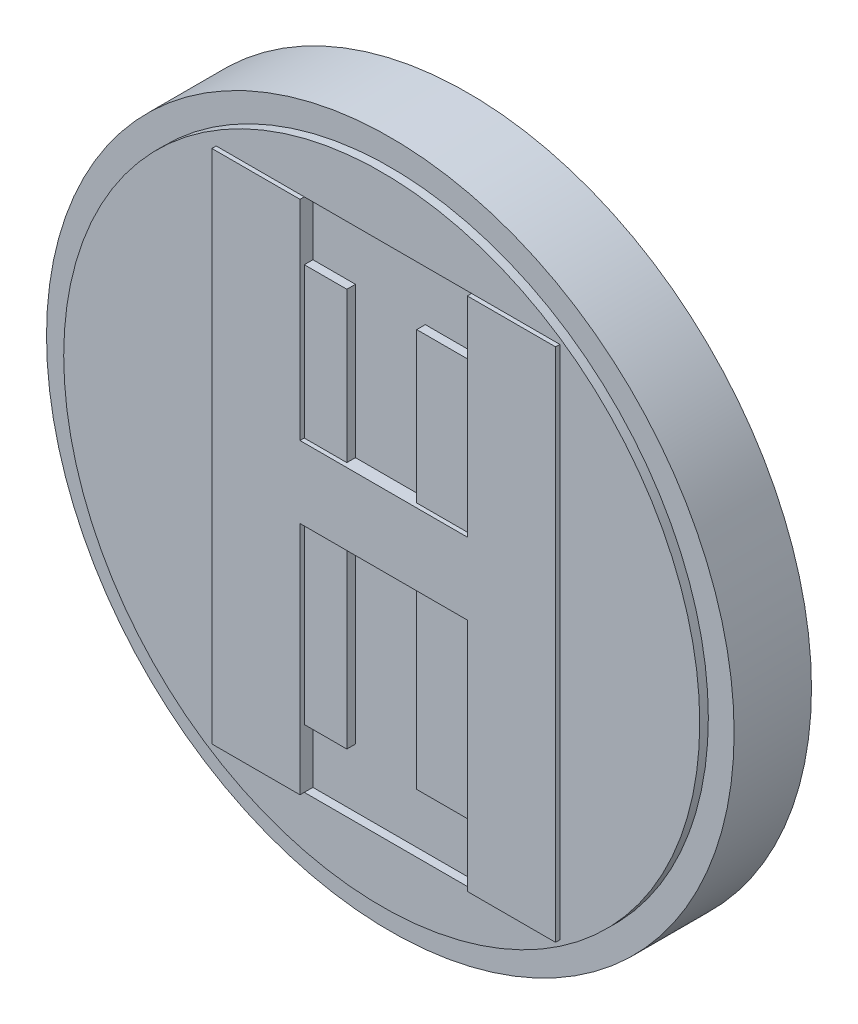
ISO-10303-21;
HEADER;
FILE_DESCRIPTION(('STEP AP214'),'2;1');
FILE_NAME('part.step','',(''),(''),'','','');
FILE_SCHEMA(('AUTOMOTIVE_DESIGN { 1 0 10303 214 1 1 1 1 }'));
ENDSEC;
DATA;
#1=APPLICATION_CONTEXT('core data for automotive mechanical design processes');
#2=APPLICATION_PROTOCOL_DEFINITION('international standard','automotive_design',2000,#1);
#3=PRODUCT_CONTEXT('',#1,'mechanical');
#4=PRODUCT('Part','Part','',(#3));
#5=PRODUCT_RELATED_PRODUCT_CATEGORY('part','',(#4));
#6=PRODUCT_DEFINITION_FORMATION('','',#4);
#7=PRODUCT_DEFINITION_CONTEXT('part definition',#1,'design');
#8=PRODUCT_DEFINITION('design','',#6,#7);
#9=PRODUCT_DEFINITION_SHAPE('','',#8);
#10=(LENGTH_UNIT() NAMED_UNIT(*) SI_UNIT(.MILLI.,.METRE.));
#11=(NAMED_UNIT(*) PLANE_ANGLE_UNIT() SI_UNIT($,.RADIAN.));
#12=(NAMED_UNIT(*) SI_UNIT($,.STERADIAN.) SOLID_ANGLE_UNIT());
#13=UNCERTAINTY_MEASURE_WITH_UNIT(LENGTH_MEASURE(1.E-05),#10,'distance_accuracy_value','');
#14=(GEOMETRIC_REPRESENTATION_CONTEXT(3) GLOBAL_UNCERTAINTY_ASSIGNED_CONTEXT((#13)) GLOBAL_UNIT_ASSIGNED_CONTEXT((#10,
#11,#12)) REPRESENTATION_CONTEXT('',''));
#15=CARTESIAN_POINT('',(0.,0.,0.));
#16=DIRECTION('',(0.,0.,1.));
#17=DIRECTION('',(1.,0.,0.));
#18=AXIS2_PLACEMENT_3D('',#15,#16,#17);
#19=CARTESIAN_POINT('',(0.,0.,0.));
#20=DIRECTION('',(0.,0.,1.));
#21=DIRECTION('',(1.,0.,0.));
#22=AXIS2_PLACEMENT_3D('',#19,#20,#21);
#23=PLANE('',#22);
#24=DIRECTION('',(1.,0.,0.));
#25=VECTOR('',#24,1.);
#26=CARTESIAN_POINT('',(0.,-30.,0.));
#27=LINE('',#26,#25);
#28=CARTESIAN_POINT('',(-19.2602848101266,-30.,0.));
#29=VERTEX_POINT('',#28);
#30=CARTESIAN_POINT('',(-9.00712025316456,-30.,0.));
#31=VERTEX_POINT('',#30);
#32=EDGE_CURVE('E58',#29,#31,#27,.T.);
#33=ORIENTED_EDGE('',*,*,#32,.F.);
#34=DIRECTION('',(0.,-1.,0.));
#35=VECTOR('',#34,1.);
#36=CARTESIAN_POINT('',(-19.2602848101266,0.,0.));
#37=LINE('',#36,#35);
#38=CARTESIAN_POINT('',(-19.2602848101266,30.,0.));
#39=VERTEX_POINT('',#38);
#40=EDGE_CURVE('E11',#39,#29,#37,.T.);
#41=ORIENTED_EDGE('',*,*,#40,.F.);
#42=DIRECTION('',(1.,0.,0.));
#43=VECTOR('',#42,1.);
#44=CARTESIAN_POINT('',(0.,30.,0.));
#45=LINE('',#44,#43);
#46=CARTESIAN_POINT('',(-9.00712025316456,30.,0.));
#47=VERTEX_POINT('',#46);
#48=EDGE_CURVE('E397',#39,#47,#45,.T.);
#49=ORIENTED_EDGE('',*,*,#48,.T.);
#50=CARTESIAN_POINT('',(10.4549050632911,30.,0.));
#51=VERTEX_POINT('',#50);
#52=EDGE_CURVE('E396',#47,#51,#45,.T.);
#53=ORIENTED_EDGE('',*,*,#52,.T.);
#54=DIRECTION('',(-1.,0.,0.));
#55=VECTOR('',#54,1.);
#56=CARTESIAN_POINT('',(0.,30.,0.));
#57=LINE('',#56,#55);
#58=CARTESIAN_POINT('',(20.7199367088608,30.,0.));
#59=VERTEX_POINT('',#58);
#60=EDGE_CURVE('E319',#59,#51,#57,.T.);
#61=ORIENTED_EDGE('',*,*,#60,.F.);
#62=DIRECTION('',(0.,1.,0.));
#63=VECTOR('',#62,1.);
#64=CARTESIAN_POINT('',(20.7199367088608,0.,0.));
#65=LINE('',#64,#63);
#66=CARTESIAN_POINT('',(20.7199367088608,-30.,0.));
#67=VERTEX_POINT('',#66);
#68=EDGE_CURVE('E43',#67,#59,#65,.T.);
#69=ORIENTED_EDGE('',*,*,#68,.F.);
#70=DIRECTION('',(-1.,0.,0.));
#71=VECTOR('',#70,1.);
#72=CARTESIAN_POINT('',(0.,-30.,0.));
#73=LINE('',#72,#71);
#74=CARTESIAN_POINT('',(10.4549050632911,-30.,0.));
#75=VERTEX_POINT('',#74);
#76=EDGE_CURVE('E356',#67,#75,#73,.T.);
#77=ORIENTED_EDGE('',*,*,#76,.T.);
#78=EDGE_CURVE('E355',#75,#31,#73,.T.);
#79=ORIENTED_EDGE('',*,*,#78,.T.);
#80=EDGE_LOOP('',(#33,#41,#49,#53,#61,#69,#77,#79));
#81=FACE_BOUND('',#80,.T.);
#82=CARTESIAN_POINT('',(0.,0.,0.));
#83=DIRECTION('',(0.,0.,1.));
#84=DIRECTION('',(1.,0.,0.));
#85=AXIS2_PLACEMENT_3D('',#82,#83,#84);
#86=CIRCLE('',#85,37.);
#87=CARTESIAN_POINT('',(37.,0.,0.));
#88=VERTEX_POINT('',#87);
#89=EDGE_CURVE('E244',#88,#88,#86,.T.);
#90=ORIENTED_EDGE('',*,*,#89,.T.);
#91=EDGE_LOOP('',(#90));
#92=FACE_BOUND('',#91,.T.);
#93=ADVANCED_FACE('F35',(#81,#92),#23,.T.);
#94=DIRECTION('',(1.,0.,0.));
#95=VECTOR('',#94,1.);
#96=CARTESIAN_POINT('',(0.,-2.65822784810127,0.));
#97=LINE('',#96,#95);
#98=CARTESIAN_POINT('',(-9.00712025316456,-2.65822784810127,0.));
#99=VERTEX_POINT('',#98);
#100=CARTESIAN_POINT('',(-4.05854430379747,-2.65822784810127,0.));
#101=VERTEX_POINT('',#100);
#102=EDGE_CURVE('E50',#99,#101,#97,.T.);
#103=ORIENTED_EDGE('',*,*,#102,.F.);
#104=DIRECTION('',(0.,1.,0.));
#105=VECTOR('',#104,1.);
#106=CARTESIAN_POINT('',(-9.00712025316456,0.,0.));
#107=LINE('',#106,#105);
#108=CARTESIAN_POINT('',(-9.00712025316456,-23.1645569620253,0.));
#109=VERTEX_POINT('',#108);
#110=EDGE_CURVE('E316',#109,#99,#107,.T.);
#111=ORIENTED_EDGE('',*,*,#110,.F.);
#112=DIRECTION('',(1.,0.,0.));
#113=VECTOR('',#112,1.);
#114=CARTESIAN_POINT('',(0.,-23.1645569620253,0.));
#115=LINE('',#114,#113);
#116=CARTESIAN_POINT('',(-4.05854430379747,-23.1645569620253,0.));
#117=VERTEX_POINT('',#116);
#118=EDGE_CURVE('E337',#109,#117,#115,.T.);
#119=ORIENTED_EDGE('',*,*,#118,.T.);
#120=DIRECTION('',(0.,1.,0.));
#121=VECTOR('',#120,1.);
#122=CARTESIAN_POINT('',(-4.05854430379747,0.,0.));
#123=LINE('',#122,#121);
#124=EDGE_CURVE('E341',#117,#101,#123,.T.);
#125=ORIENTED_EDGE('',*,*,#124,.T.);
#126=EDGE_LOOP('',(#103,#111,#119,#125));
#127=FACE_BOUND('',#126,.T.);
#128=ADVANCED_FACE('F496',(#127),#23,.T.);
#129=DIRECTION('',(0.,1.,0.));
#130=VECTOR('',#129,1.);
#131=CARTESIAN_POINT('',(-9.00712025316456,0.,0.));
#132=LINE('',#131,#130);
#133=CARTESIAN_POINT('',(-9.00712025316456,5.69620253164557,0.));
#134=VERTEX_POINT('',#133);
#135=CARTESIAN_POINT('',(-9.00712025316456,23.1645569620253,0.));
#136=VERTEX_POINT('',#135);
#137=EDGE_CURVE('E334',#134,#136,#132,.T.);
#138=ORIENTED_EDGE('',*,*,#137,.F.);
#139=DIRECTION('',(-1.,0.,0.));
#140=VECTOR('',#139,1.);
#141=CARTESIAN_POINT('',(0.,5.69620253164557,0.));
#142=LINE('',#141,#140);
#143=CARTESIAN_POINT('',(-4.05854430379747,5.69620253164557,0.));
#144=VERTEX_POINT('',#143);
#145=EDGE_CURVE('E327',#144,#134,#142,.T.);
#146=ORIENTED_EDGE('',*,*,#145,.F.);
#147=DIRECTION('',(0.,1.,0.));
#148=VECTOR('',#147,1.);
#149=CARTESIAN_POINT('',(-4.05854430379747,0.,0.));
#150=LINE('',#149,#148);
#151=CARTESIAN_POINT('',(-4.05854430379747,23.1645569620253,0.));
#152=VERTEX_POINT('',#151);
#153=EDGE_CURVE('E379',#144,#152,#150,.T.);
#154=ORIENTED_EDGE('',*,*,#153,.T.);
#155=DIRECTION('',(-1.,0.,0.));
#156=VECTOR('',#155,1.);
#157=CARTESIAN_POINT('',(0.,23.1645569620253,0.));
#158=LINE('',#157,#156);
#159=EDGE_CURVE('E400',#152,#136,#158,.T.);
#160=ORIENTED_EDGE('',*,*,#159,.T.);
#161=EDGE_LOOP('',(#138,#146,#154,#160));
#162=FACE_BOUND('',#161,.T.);
#163=ADVANCED_FACE('F500',(#162),#23,.T.);
#164=CARTESIAN_POINT('',(10.4549050632911,5.69620253164557,0.));
#165=VERTEX_POINT('',#164);
#166=CARTESIAN_POINT('',(4.07041139240506,5.69620253164557,0.));
#167=VERTEX_POINT('',#166);
#168=EDGE_CURVE('E328',#165,#167,#142,.T.);
#169=ORIENTED_EDGE('',*,*,#168,.F.);
#170=DIRECTION('',(0.,-1.,0.));
#171=VECTOR('',#170,1.);
#172=CARTESIAN_POINT('',(10.4549050632911,0.,0.));
#173=LINE('',#172,#171);
#174=CARTESIAN_POINT('',(10.4549050632911,23.1645569620253,0.));
#175=VERTEX_POINT('',#174);
#176=EDGE_CURVE('E324',#175,#165,#173,.T.);
#177=ORIENTED_EDGE('',*,*,#176,.F.);
#178=DIRECTION('',(-1.,0.,0.));
#179=VECTOR('',#178,1.);
#180=CARTESIAN_POINT('',(0.,23.1645569620253,0.));
#181=LINE('',#180,#179);
#182=CARTESIAN_POINT('',(4.07041139240506,23.1645569620253,0.));
#183=VERTEX_POINT('',#182);
#184=EDGE_CURVE('E394',#175,#183,#181,.T.);
#185=ORIENTED_EDGE('',*,*,#184,.T.);
#186=DIRECTION('',(0.,-1.,0.));
#187=VECTOR('',#186,1.);
#188=CARTESIAN_POINT('',(4.07041139240506,0.,0.));
#189=LINE('',#188,#187);
#190=EDGE_CURVE('E369',#183,#167,#189,.T.);
#191=ORIENTED_EDGE('',*,*,#190,.T.);
#192=EDGE_LOOP('',(#169,#177,#185,#191));
#193=FACE_BOUND('',#192,.T.);
#194=ADVANCED_FACE('F503',(#193),#23,.T.);
#195=CARTESIAN_POINT('',(4.07041139240506,-2.65822784810127,0.));
#196=VERTEX_POINT('',#195);
#197=CARTESIAN_POINT('',(10.4549050632911,-2.65822784810127,0.));
#198=VERTEX_POINT('',#197);
#199=EDGE_CURVE('E217',#196,#198,#97,.T.);
#200=ORIENTED_EDGE('',*,*,#199,.F.);
#201=DIRECTION('',(0.,-1.,0.));
#202=VECTOR('',#201,1.);
#203=CARTESIAN_POINT('',(4.07041139240506,0.,0.));
#204=LINE('',#203,#202);
#205=CARTESIAN_POINT('',(4.07041139240506,-23.1645569620253,0.));
#206=VERTEX_POINT('',#205);
#207=EDGE_CURVE('E362',#196,#206,#204,.T.);
#208=ORIENTED_EDGE('',*,*,#207,.T.);
#209=DIRECTION('',(1.,0.,0.));
#210=VECTOR('',#209,1.);
#211=CARTESIAN_POINT('',(0.,-23.1645569620253,0.));
#212=LINE('',#211,#210);
#213=CARTESIAN_POINT('',(10.4549050632911,-23.1645569620253,0.));
#214=VERTEX_POINT('',#213);
#215=EDGE_CURVE('E359',#206,#214,#212,.T.);
#216=ORIENTED_EDGE('',*,*,#215,.T.);
#217=DIRECTION('',(0.,-1.,0.));
#218=VECTOR('',#217,1.);
#219=CARTESIAN_POINT('',(10.4549050632911,0.,0.));
#220=LINE('',#219,#218);
#221=EDGE_CURVE('E310',#198,#214,#220,.T.);
#222=ORIENTED_EDGE('',*,*,#221,.F.);
#223=EDGE_LOOP('',(#200,#208,#216,#222));
#224=FACE_BOUND('',#223,.T.);
#225=ADVANCED_FACE('F480',(#224),#23,.T.);
#226=CARTESIAN_POINT('',(0.,5.69620253164557,-1.));
#227=DIRECTION('',(0.,1.,0.));
#228=DIRECTION('',(0.,0.,1.));
#229=AXIS2_PLACEMENT_3D('',#226,#227,#228);
#230=PLANE('',#229);
#231=DIRECTION('',(0.,0.,1.));
#232=VECTOR('',#231,1.);
#233=CARTESIAN_POINT('',(-4.05854430379747,5.69620253164557,-1.));
#234=LINE('',#233,#232);
#235=CARTESIAN_POINT('',(-4.05854430379747,5.69620253164557,-1.));
#236=VERTEX_POINT('',#235);
#237=EDGE_CURVE('E405',#236,#144,#234,.T.);
#238=ORIENTED_EDGE('',*,*,#237,.T.);
#239=ORIENTED_EDGE('',*,*,#145,.T.);
#240=DIRECTION('',(0.,0.,1.));
#241=VECTOR('',#240,1.);
#242=CARTESIAN_POINT('',(-9.00712025316456,5.69620253164557,-1.));
#243=LINE('',#242,#241);
#244=CARTESIAN_POINT('',(-9.00712025316456,5.69620253164557,0.5));
#245=VERTEX_POINT('',#244);
#246=EDGE_CURVE('E294',#134,#245,#243,.T.);
#247=ORIENTED_EDGE('',*,*,#246,.T.);
#248=DIRECTION('',(-1.,0.,0.));
#249=VECTOR('',#248,1.);
#250=CARTESIAN_POINT('',(0.,5.69620253164557,0.5));
#251=LINE('',#250,#249);
#252=CARTESIAN_POINT('',(10.4549050632911,5.69620253164557,0.5));
#253=VERTEX_POINT('',#252);
#254=EDGE_CURVE('E256',#253,#245,#251,.T.);
#255=ORIENTED_EDGE('',*,*,#254,.F.);
#256=DIRECTION('',(0.,0.,1.));
#257=VECTOR('',#256,1.);
#258=CARTESIAN_POINT('',(10.4549050632911,5.69620253164557,-1.));
#259=LINE('',#258,#257);
#260=EDGE_CURVE('E296',#165,#253,#259,.T.);
#261=ORIENTED_EDGE('',*,*,#260,.F.);
#262=ORIENTED_EDGE('',*,*,#168,.T.);
#263=DIRECTION('',(0.,0.,1.));
#264=VECTOR('',#263,1.);
#265=CARTESIAN_POINT('',(4.07041139240506,5.69620253164557,-1.));
#266=LINE('',#265,#264);
#267=CARTESIAN_POINT('',(4.07041139240506,5.69620253164557,-1.));
#268=VERTEX_POINT('',#267);
#269=EDGE_CURVE('E391',#268,#167,#266,.T.);
#270=ORIENTED_EDGE('',*,*,#269,.F.);
#271=DIRECTION('',(-1.,0.,0.));
#272=VECTOR('',#271,1.);
#273=CARTESIAN_POINT('',(0.,5.69620253164557,-1.));
#274=LINE('',#273,#272);
#275=EDGE_CURVE('E375',#268,#236,#274,.T.);
#276=ORIENTED_EDGE('',*,*,#275,.T.);
#277=EDGE_LOOP('',(#238,#239,#247,#255,#261,#262,#270,#276));
#278=FACE_BOUND('',#277,.T.);
#279=ADVANCED_FACE('F437',(#278),#230,.T.);
#280=CARTESIAN_POINT('',(-4.05854430379747,0.,-1.));
#281=DIRECTION('',(1.,0.,0.));
#282=DIRECTION('',(0.,0.,-1.));
#283=AXIS2_PLACEMENT_3D('',#280,#281,#282);
#284=PLANE('',#283);
#285=ORIENTED_EDGE('',*,*,#153,.F.);
#286=ORIENTED_EDGE('',*,*,#237,.F.);
#287=DIRECTION('',(0.,1.,0.));
#288=VECTOR('',#287,1.);
#289=CARTESIAN_POINT('',(-4.05854430379747,0.,-1.));
#290=LINE('',#289,#288);
#291=CARTESIAN_POINT('',(-4.05854430379747,23.1645569620253,-1.));
#292=VERTEX_POINT('',#291);
#293=EDGE_CURVE('E389',#236,#292,#290,.T.);
#294=ORIENTED_EDGE('',*,*,#293,.T.);
#295=DIRECTION('',(0.,0.,1.));
#296=VECTOR('',#295,1.);
#297=CARTESIAN_POINT('',(-4.05854430379747,23.1645569620253,-1.));
#298=LINE('',#297,#296);
#299=EDGE_CURVE('E409',#292,#152,#298,.T.);
#300=ORIENTED_EDGE('',*,*,#299,.T.);
#301=EDGE_LOOP('',(#285,#286,#294,#300));
#302=FACE_BOUND('',#301,.T.);
#303=ADVANCED_FACE('F508',(#302),#284,.T.);
#304=CARTESIAN_POINT('',(0.,23.1645569620253,-1.));
#305=DIRECTION('',(0.,1.,0.));
#306=DIRECTION('',(0.,0.,1.));
#307=AXIS2_PLACEMENT_3D('',#304,#305,#306);
#308=PLANE('',#307);
#309=DIRECTION('',(0.,0.,-1.));
#310=VECTOR('',#309,1.);
#311=CARTESIAN_POINT('',(-9.00712025316456,23.1645569620253,-1.));
#312=LINE('',#311,#310);
#313=CARTESIAN_POINT('',(-9.00712025316456,23.1645569620253,-1.));
#314=VERTEX_POINT('',#313);
#315=EDGE_CURVE('E331',#136,#314,#312,.T.);
#316=ORIENTED_EDGE('',*,*,#315,.F.);
#317=ORIENTED_EDGE('',*,*,#159,.F.);
#318=ORIENTED_EDGE('',*,*,#299,.F.);
#319=DIRECTION('',(-1.,0.,0.));
#320=VECTOR('',#319,1.);
#321=CARTESIAN_POINT('',(0.,23.1645569620253,-1.));
#322=LINE('',#321,#320);
#323=EDGE_CURVE('E386',#292,#314,#322,.T.);
#324=ORIENTED_EDGE('',*,*,#323,.T.);
#325=EDGE_LOOP('',(#316,#317,#318,#324));
#326=FACE_BOUND('',#325,.T.);
#327=ADVANCED_FACE('F532',(#326),#308,.T.);
#328=CARTESIAN_POINT('',(0.,30.,-1.));
#329=DIRECTION('',(0.,-1.,0.));
#330=DIRECTION('',(0.,0.,-1.));
#331=AXIS2_PLACEMENT_3D('',#328,#329,#330);
#332=PLANE('',#331);
#333=DIRECTION('',(0.,0.,1.));
#334=VECTOR('',#333,1.);
#335=CARTESIAN_POINT('',(-9.00712025316456,30.,-1.));
#336=LINE('',#335,#334);
#337=CARTESIAN_POINT('',(-9.00712025316456,30.,-1.));
#338=VERTEX_POINT('',#337);
#339=EDGE_CURVE('E290',#338,#47,#336,.T.);
#340=ORIENTED_EDGE('',*,*,#339,.F.);
#341=DIRECTION('',(1.,0.,0.));
#342=VECTOR('',#341,1.);
#343=CARTESIAN_POINT('',(0.,30.,-1.));
#344=LINE('',#343,#342);
#345=CARTESIAN_POINT('',(10.4549050632911,30.,-1.));
#346=VERTEX_POINT('',#345);
#347=EDGE_CURVE('E383',#338,#346,#344,.T.);
#348=ORIENTED_EDGE('',*,*,#347,.T.);
#349=DIRECTION('',(0.,0.,1.));
#350=VECTOR('',#349,1.);
#351=CARTESIAN_POINT('',(10.4549050632911,30.,-1.));
#352=LINE('',#351,#350);
#353=EDGE_CURVE('E298',#346,#51,#352,.T.);
#354=ORIENTED_EDGE('',*,*,#353,.T.);
#355=ORIENTED_EDGE('',*,*,#52,.F.);
#356=EDGE_LOOP('',(#340,#348,#354,#355));
#357=FACE_BOUND('',#356,.T.);
#358=ADVANCED_FACE('F535',(#357),#332,.T.);
#359=CARTESIAN_POINT('',(0.,23.1645569620253,-1.));
#360=DIRECTION('',(0.,1.,0.));
#361=DIRECTION('',(0.,0.,1.));
#362=AXIS2_PLACEMENT_3D('',#359,#360,#361);
#363=PLANE('',#362);
#364=DIRECTION('',(0.,0.,1.));
#365=VECTOR('',#364,1.);
#366=CARTESIAN_POINT('',(10.4549050632911,23.1645569620253,-1.));
#367=LINE('',#366,#365);
#368=CARTESIAN_POINT('',(10.4549050632911,23.1645569620253,-1.));
#369=VERTEX_POINT('',#368);
#370=EDGE_CURVE('E321',#369,#175,#367,.T.);
#371=ORIENTED_EDGE('',*,*,#370,.F.);
#372=DIRECTION('',(-1.,0.,0.));
#373=VECTOR('',#372,1.);
#374=CARTESIAN_POINT('',(0.,23.1645569620253,-1.));
#375=LINE('',#374,#373);
#376=CARTESIAN_POINT('',(4.07041139240506,23.1645569620253,-1.));
#377=VERTEX_POINT('',#376);
#378=EDGE_CURVE('E381',#369,#377,#375,.T.);
#379=ORIENTED_EDGE('',*,*,#378,.T.);
#380=DIRECTION('',(0.,0.,1.));
#381=VECTOR('',#380,1.);
#382=CARTESIAN_POINT('',(4.07041139240506,23.1645569620253,-1.));
#383=LINE('',#382,#381);
#384=EDGE_CURVE('E411',#377,#183,#383,.T.);
#385=ORIENTED_EDGE('',*,*,#384,.T.);
#386=ORIENTED_EDGE('',*,*,#184,.F.);
#387=EDGE_LOOP('',(#371,#379,#385,#386));
#388=FACE_BOUND('',#387,.T.);
#389=ADVANCED_FACE('F538',(#388),#363,.T.);
#390=CARTESIAN_POINT('',(4.07041139240506,0.,-1.));
#391=DIRECTION('',(-1.,0.,0.));
#392=DIRECTION('',(0.,0.,1.));
#393=AXIS2_PLACEMENT_3D('',#390,#391,#392);
#394=PLANE('',#393);
#395=ORIENTED_EDGE('',*,*,#190,.F.);
#396=ORIENTED_EDGE('',*,*,#384,.F.);
#397=DIRECTION('',(0.,-1.,0.));
#398=VECTOR('',#397,1.);
#399=CARTESIAN_POINT('',(4.07041139240506,0.,-1.));
#400=LINE('',#399,#398);
#401=EDGE_CURVE('E378',#377,#268,#400,.T.);
#402=ORIENTED_EDGE('',*,*,#401,.T.);
#403=ORIENTED_EDGE('',*,*,#269,.T.);
#404=EDGE_LOOP('',(#395,#396,#402,#403));
#405=FACE_BOUND('',#404,.T.);
#406=ADVANCED_FACE('F519',(#405),#394,.T.);
#407=CARTESIAN_POINT('',(0.,0.,-1.));
#408=DIRECTION('',(0.,0.,1.));
#409=DIRECTION('',(1.,0.,0.));
#410=AXIS2_PLACEMENT_3D('',#407,#408,#409);
#411=PLANE('',#410);
#412=DIRECTION('',(0.,1.,0.));
#413=VECTOR('',#412,1.);
#414=CARTESIAN_POINT('',(-9.00712025316456,0.,-1.));
#415=LINE('',#414,#413);
#416=EDGE_CURVE('E274',#314,#338,#415,.T.);
#417=ORIENTED_EDGE('',*,*,#416,.F.);
#418=ORIENTED_EDGE('',*,*,#323,.F.);
#419=ORIENTED_EDGE('',*,*,#293,.F.);
#420=ORIENTED_EDGE('',*,*,#275,.F.);
#421=ORIENTED_EDGE('',*,*,#401,.F.);
#422=ORIENTED_EDGE('',*,*,#378,.F.);
#423=DIRECTION('',(0.,-1.,0.));
#424=VECTOR('',#423,1.);
#425=CARTESIAN_POINT('',(10.4549050632911,0.,-1.));
#426=LINE('',#425,#424);
#427=EDGE_CURVE('E271',#346,#369,#426,.T.);
#428=ORIENTED_EDGE('',*,*,#427,.F.);
#429=ORIENTED_EDGE('',*,*,#347,.F.);
#430=EDGE_LOOP('',(#417,#418,#419,#420,#421,#422,#428,#429));
#431=FACE_BOUND('',#430,.T.);
#432=ADVANCED_FACE('F524',(#431),#411,.T.);
#433=CARTESIAN_POINT('',(0.,-23.1645569620253,-1.));
#434=DIRECTION('',(0.,-1.,0.));
#435=DIRECTION('',(0.,0.,-1.));
#436=AXIS2_PLACEMENT_3D('',#433,#434,#435);
#437=PLANE('',#436);
#438=DIRECTION('',(0.,0.,1.));
#439=VECTOR('',#438,1.);
#440=CARTESIAN_POINT('',(-9.00712025316456,-23.1645569620253,-1.));
#441=LINE('',#440,#439);
#442=CARTESIAN_POINT('',(-9.00712025316456,-23.1645569620253,-1.));
#443=VERTEX_POINT('',#442);
#444=EDGE_CURVE('E313',#443,#109,#441,.T.);
#445=ORIENTED_EDGE('',*,*,#444,.F.);
#446=DIRECTION('',(1.,0.,0.));
#447=VECTOR('',#446,1.);
#448=CARTESIAN_POINT('',(0.,-23.1645569620253,-1.));
#449=LINE('',#448,#447);
#450=CARTESIAN_POINT('',(-4.05854430379747,-23.1645569620253,-1.));
#451=VERTEX_POINT('',#450);
#452=EDGE_CURVE('E338',#443,#451,#449,.T.);
#453=ORIENTED_EDGE('',*,*,#452,.T.);
#454=DIRECTION('',(0.,0.,1.));
#455=VECTOR('',#454,1.);
#456=CARTESIAN_POINT('',(-4.05854430379747,-23.1645569620253,-1.));
#457=LINE('',#456,#455);
#458=EDGE_CURVE('E366',#451,#117,#457,.T.);
#459=ORIENTED_EDGE('',*,*,#458,.T.);
#460=ORIENTED_EDGE('',*,*,#118,.F.);
#461=EDGE_LOOP('',(#445,#453,#459,#460));
#462=FACE_BOUND('',#461,.T.);
#463=ADVANCED_FACE('F765',(#462),#437,.T.);
#464=CARTESIAN_POINT('',(-4.05854430379747,0.,-1.));
#465=DIRECTION('',(1.,0.,0.));
#466=DIRECTION('',(0.,0.,-1.));
#467=AXIS2_PLACEMENT_3D('',#464,#465,#466);
#468=PLANE('',#467);
#469=ORIENTED_EDGE('',*,*,#124,.F.);
#470=ORIENTED_EDGE('',*,*,#458,.F.);
#471=DIRECTION('',(0.,1.,0.));
#472=VECTOR('',#471,1.);
#473=CARTESIAN_POINT('',(-4.05854430379747,0.,-1.));
#474=LINE('',#473,#472);
#475=CARTESIAN_POINT('',(-4.05854430379747,-2.65822784810127,-1.));
#476=VERTEX_POINT('',#475);
#477=EDGE_CURVE('E351',#451,#476,#474,.T.);
#478=ORIENTED_EDGE('',*,*,#477,.T.);
#479=DIRECTION('',(0.,0.,1.));
#480=VECTOR('',#479,1.);
#481=CARTESIAN_POINT('',(-4.05854430379747,-2.65822784810127,-1.));
#482=LINE('',#481,#480);
#483=EDGE_CURVE('E370',#476,#101,#482,.T.);
#484=ORIENTED_EDGE('',*,*,#483,.T.);
#485=EDGE_LOOP('',(#469,#470,#478,#484));
#486=FACE_BOUND('',#485,.T.);
#487=ADVANCED_FACE('F755',(#486),#468,.T.);
#488=CARTESIAN_POINT('',(0.,-2.65822784810127,-1.));
#489=DIRECTION('',(0.,-1.,0.));
#490=DIRECTION('',(0.,0.,-1.));
#491=AXIS2_PLACEMENT_3D('',#488,#489,#490);
#492=PLANE('',#491);
#493=DIRECTION('',(0.,0.,1.));
#494=VECTOR('',#493,1.);
#495=CARTESIAN_POINT('',(4.07041139240506,-2.65822784810127,-1.));
#496=LINE('',#495,#494);
#497=CARTESIAN_POINT('',(4.07041139240506,-2.65822784810127,-1.));
#498=VERTEX_POINT('',#497);
#499=EDGE_CURVE('E372',#498,#196,#496,.T.);
#500=ORIENTED_EDGE('',*,*,#499,.T.);
#501=ORIENTED_EDGE('',*,*,#199,.T.);
#502=DIRECTION('',(0.,0.,1.));
#503=VECTOR('',#502,1.);
#504=CARTESIAN_POINT('',(10.4549050632911,-2.65822784810127,-1.));
#505=LINE('',#504,#503);
#506=CARTESIAN_POINT('',(10.4549050632911,-2.65822784810127,0.5));
#507=VERTEX_POINT('',#506);
#508=EDGE_CURVE('E210',#198,#507,#505,.T.);
#509=ORIENTED_EDGE('',*,*,#508,.T.);
#510=DIRECTION('',(1.,0.,0.));
#511=VECTOR('',#510,1.);
#512=CARTESIAN_POINT('',(0.,-2.65822784810127,0.5));
#513=LINE('',#512,#511);
#514=CARTESIAN_POINT('',(-9.00712025316456,-2.65822784810127,0.5));
#515=VERTEX_POINT('',#514);
#516=EDGE_CURVE('E216',#515,#507,#513,.T.);
#517=ORIENTED_EDGE('',*,*,#516,.F.);
#518=DIRECTION('',(0.,0.,1.));
#519=VECTOR('',#518,1.);
#520=CARTESIAN_POINT('',(-9.00712025316456,-2.65822784810127,-1.));
#521=LINE('',#520,#519);
#522=EDGE_CURVE('E279',#99,#515,#521,.T.);
#523=ORIENTED_EDGE('',*,*,#522,.F.);
#524=ORIENTED_EDGE('',*,*,#102,.T.);
#525=ORIENTED_EDGE('',*,*,#483,.F.);
#526=DIRECTION('',(1.,0.,0.));
#527=VECTOR('',#526,1.);
#528=CARTESIAN_POINT('',(0.,-2.65822784810127,-1.));
#529=LINE('',#528,#527);
#530=EDGE_CURVE('E349',#476,#498,#529,.T.);
#531=ORIENTED_EDGE('',*,*,#530,.T.);
#532=EDGE_LOOP('',(#500,#501,#509,#517,#523,#524,#525,#531));
#533=FACE_BOUND('',#532,.T.);
#534=ADVANCED_FACE('F213',(#533),#492,.T.);
#535=CARTESIAN_POINT('',(4.07041139240506,0.,-1.));
#536=DIRECTION('',(-1.,0.,0.));
#537=DIRECTION('',(0.,0.,1.));
#538=AXIS2_PLACEMENT_3D('',#535,#536,#537);
#539=PLANE('',#538);
#540=ORIENTED_EDGE('',*,*,#207,.F.);
#541=ORIENTED_EDGE('',*,*,#499,.F.);
#542=DIRECTION('',(0.,-1.,0.));
#543=VECTOR('',#542,1.);
#544=CARTESIAN_POINT('',(4.07041139240506,0.,-1.));
#545=LINE('',#544,#543);
#546=CARTESIAN_POINT('',(4.07041139240506,-23.1645569620253,-1.));
#547=VERTEX_POINT('',#546);
#548=EDGE_CURVE('E347',#498,#547,#545,.T.);
#549=ORIENTED_EDGE('',*,*,#548,.T.);
#550=DIRECTION('',(0.,0.,1.));
#551=VECTOR('',#550,1.);
#552=CARTESIAN_POINT('',(4.07041139240506,-23.1645569620253,-1.));
#553=LINE('',#552,#551);
#554=EDGE_CURVE('E353',#547,#206,#553,.T.);
#555=ORIENTED_EDGE('',*,*,#554,.T.);
#556=EDGE_LOOP('',(#540,#541,#549,#555));
#557=FACE_BOUND('',#556,.T.);
#558=ADVANCED_FACE('F475',(#557),#539,.T.);
#559=CARTESIAN_POINT('',(0.,-23.1645569620253,-1.));
#560=DIRECTION('',(0.,-1.,0.));
#561=DIRECTION('',(0.,0.,-1.));
#562=AXIS2_PLACEMENT_3D('',#559,#560,#561);
#563=PLANE('',#562);
#564=DIRECTION('',(0.,0.,-1.));
#565=VECTOR('',#564,1.);
#566=CARTESIAN_POINT('',(10.4549050632911,-23.1645569620253,-1.));
#567=LINE('',#566,#565);
#568=CARTESIAN_POINT('',(10.4549050632911,-23.1645569620253,-1.));
#569=VERTEX_POINT('',#568);
#570=EDGE_CURVE('E281',#214,#569,#567,.T.);
#571=ORIENTED_EDGE('',*,*,#570,.F.);
#572=ORIENTED_EDGE('',*,*,#215,.F.);
#573=ORIENTED_EDGE('',*,*,#554,.F.);
#574=DIRECTION('',(1.,0.,0.));
#575=VECTOR('',#574,1.);
#576=CARTESIAN_POINT('',(0.,-23.1645569620253,-1.));
#577=LINE('',#576,#575);
#578=EDGE_CURVE('E344',#547,#569,#577,.T.);
#579=ORIENTED_EDGE('',*,*,#578,.T.);
#580=EDGE_LOOP('',(#571,#572,#573,#579));
#581=FACE_BOUND('',#580,.T.);
#582=ADVANCED_FACE('F478',(#581),#563,.T.);
#583=CARTESIAN_POINT('',(0.,-30.,-1.));
#584=DIRECTION('',(0.,1.,0.));
#585=DIRECTION('',(0.,0.,1.));
#586=AXIS2_PLACEMENT_3D('',#583,#584,#585);
#587=PLANE('',#586);
#588=DIRECTION('',(0.,0.,1.));
#589=VECTOR('',#588,1.);
#590=CARTESIAN_POINT('',(-9.00712025316456,-30.,-1.));
#591=LINE('',#590,#589);
#592=CARTESIAN_POINT('',(-9.00712025316456,-30.,-1.));
#593=VERTEX_POINT('',#592);
#594=EDGE_CURVE('E282',#593,#31,#591,.T.);
#595=ORIENTED_EDGE('',*,*,#594,.T.);
#596=ORIENTED_EDGE('',*,*,#78,.F.);
#597=DIRECTION('',(0.,0.,1.));
#598=VECTOR('',#597,1.);
#599=CARTESIAN_POINT('',(10.4549050632911,-30.,-1.));
#600=LINE('',#599,#598);
#601=CARTESIAN_POINT('',(10.4549050632911,-30.,-1.));
#602=VERTEX_POINT('',#601);
#603=EDGE_CURVE('E306',#602,#75,#600,.T.);
#604=ORIENTED_EDGE('',*,*,#603,.F.);
#605=DIRECTION('',(-1.,0.,0.));
#606=VECTOR('',#605,1.);
#607=CARTESIAN_POINT('',(0.,-30.,-1.));
#608=LINE('',#607,#606);
#609=EDGE_CURVE('E340',#602,#593,#608,.T.);
#610=ORIENTED_EDGE('',*,*,#609,.T.);
#611=EDGE_LOOP('',(#595,#596,#604,#610));
#612=FACE_BOUND('',#611,.T.);
#613=ADVANCED_FACE('F483',(#612),#587,.T.);
#614=CARTESIAN_POINT('',(0.,0.,-1.));
#615=DIRECTION('',(0.,0.,1.));
#616=DIRECTION('',(1.,0.,0.));
#617=AXIS2_PLACEMENT_3D('',#614,#615,#616);
#618=PLANE('',#617);
#619=DIRECTION('',(0.,1.,0.));
#620=VECTOR('',#619,1.);
#621=CARTESIAN_POINT('',(-9.00712025316456,0.,-1.));
#622=LINE('',#621,#620);
#623=EDGE_CURVE('E221',#593,#443,#622,.T.);
#624=ORIENTED_EDGE('',*,*,#623,.F.);
#625=ORIENTED_EDGE('',*,*,#609,.F.);
#626=DIRECTION('',(0.,-1.,0.));
#627=VECTOR('',#626,1.);
#628=CARTESIAN_POINT('',(10.4549050632911,0.,-1.));
#629=LINE('',#628,#627);
#630=EDGE_CURVE('E417',#569,#602,#629,.T.);
#631=ORIENTED_EDGE('',*,*,#630,.F.);
#632=ORIENTED_EDGE('',*,*,#578,.F.);
#633=ORIENTED_EDGE('',*,*,#548,.F.);
#634=ORIENTED_EDGE('',*,*,#530,.F.);
#635=ORIENTED_EDGE('',*,*,#477,.F.);
#636=ORIENTED_EDGE('',*,*,#452,.F.);
#637=EDGE_LOOP('',(#624,#625,#631,#632,#633,#634,#635,#636));
#638=FACE_BOUND('',#637,.T.);
#639=ADVANCED_FACE('F468',(#638),#618,.T.);
#640=CARTESIAN_POINT('',(-9.00712025316456,0.,-1.));
#641=DIRECTION('',(1.,0.,0.));
#642=DIRECTION('',(0.,0.,-1.));
#643=AXIS2_PLACEMENT_3D('',#640,#641,#642);
#644=PLANE('',#643);
#645=ORIENTED_EDGE('',*,*,#444,.T.);
#646=ORIENTED_EDGE('',*,*,#110,.T.);
#647=ORIENTED_EDGE('',*,*,#522,.T.);
#648=DIRECTION('',(0.,1.,0.));
#649=VECTOR('',#648,1.);
#650=CARTESIAN_POINT('',(-9.00712025316456,0.,0.5));
#651=LINE('',#650,#649);
#652=CARTESIAN_POINT('',(-9.00712025316456,-30.,0.5));
#653=VERTEX_POINT('',#652);
#654=EDGE_CURVE('E237',#653,#515,#651,.T.);
#655=ORIENTED_EDGE('',*,*,#654,.F.);
#656=EDGE_CURVE('E285',#31,#653,#591,.T.);
#657=ORIENTED_EDGE('',*,*,#656,.F.);
#658=ORIENTED_EDGE('',*,*,#594,.F.);
#659=ORIENTED_EDGE('',*,*,#623,.T.);
#660=EDGE_LOOP('',(#645,#646,#647,#655,#657,#658,#659));
#661=FACE_BOUND('',#660,.T.);
#662=ADVANCED_FACE('F458',(#661),#644,.T.);
#663=CARTESIAN_POINT('',(0.,-30.,-1.));
#664=DIRECTION('',(0.,-1.,0.));
#665=DIRECTION('',(0.,0.,-1.));
#666=AXIS2_PLACEMENT_3D('',#663,#664,#665);
#667=PLANE('',#666);
#668=DIRECTION('',(0.,0.,1.));
#669=VECTOR('',#668,1.);
#670=CARTESIAN_POINT('',(-19.2602848101266,-30.,-1.));
#671=LINE('',#670,#669);
#672=CARTESIAN_POINT('',(-19.2602848101266,-30.,0.5));
#673=VERTEX_POINT('',#672);
#674=EDGE_CURVE('E286',#29,#673,#671,.T.);
#675=ORIENTED_EDGE('',*,*,#674,.F.);
#676=ORIENTED_EDGE('',*,*,#32,.T.);
#677=ORIENTED_EDGE('',*,*,#656,.T.);
#678=DIRECTION('',(1.,0.,0.));
#679=VECTOR('',#678,1.);
#680=CARTESIAN_POINT('',(0.,-30.,0.5));
#681=LINE('',#680,#679);
#682=EDGE_CURVE('E268',#673,#653,#681,.T.);
#683=ORIENTED_EDGE('',*,*,#682,.F.);
#684=EDGE_LOOP('',(#675,#676,#677,#683));
#685=FACE_BOUND('',#684,.T.);
#686=ADVANCED_FACE('F455',(#685),#667,.T.);
#687=CARTESIAN_POINT('',(-19.2602848101266,0.,-1.));
#688=DIRECTION('',(-1.,0.,0.));
#689=DIRECTION('',(0.,0.,1.));
#690=AXIS2_PLACEMENT_3D('',#687,#688,#689);
#691=PLANE('',#690);
#692=DIRECTION('',(0.,0.,1.));
#693=VECTOR('',#692,1.);
#694=CARTESIAN_POINT('',(-19.2602848101266,30.,-1.));
#695=LINE('',#694,#693);
#696=CARTESIAN_POINT('',(-19.2602848101266,30.,0.5));
#697=VERTEX_POINT('',#696);
#698=EDGE_CURVE('E288',#39,#697,#695,.T.);
#699=ORIENTED_EDGE('',*,*,#698,.F.);
#700=ORIENTED_EDGE('',*,*,#40,.T.);
#701=ORIENTED_EDGE('',*,*,#674,.T.);
#702=DIRECTION('',(0.,-1.,0.));
#703=VECTOR('',#702,1.);
#704=CARTESIAN_POINT('',(-19.2602848101266,0.,0.5));
#705=LINE('',#704,#703);
#706=EDGE_CURVE('E265',#697,#673,#705,.T.);
#707=ORIENTED_EDGE('',*,*,#706,.F.);
#708=EDGE_LOOP('',(#699,#700,#701,#707));
#709=FACE_BOUND('',#708,.T.);
#710=ADVANCED_FACE('F452',(#709),#691,.T.);
#711=CARTESIAN_POINT('',(0.,30.,-1.));
#712=DIRECTION('',(0.,1.,0.));
#713=DIRECTION('',(0.,0.,1.));
#714=AXIS2_PLACEMENT_3D('',#711,#712,#713);
#715=PLANE('',#714);
#716=CARTESIAN_POINT('',(-9.00712025316456,30.,0.5));
#717=VERTEX_POINT('',#716);
#718=EDGE_CURVE('E293',#47,#717,#336,.T.);
#719=ORIENTED_EDGE('',*,*,#718,.F.);
#720=ORIENTED_EDGE('',*,*,#48,.F.);
#721=ORIENTED_EDGE('',*,*,#698,.T.);
#722=DIRECTION('',(-1.,0.,0.));
#723=VECTOR('',#722,1.);
#724=CARTESIAN_POINT('',(0.,30.,0.5));
#725=LINE('',#724,#723);
#726=EDGE_CURVE('E262',#717,#697,#725,.T.);
#727=ORIENTED_EDGE('',*,*,#726,.F.);
#728=EDGE_LOOP('',(#719,#720,#721,#727));
#729=FACE_BOUND('',#728,.T.);
#730=ADVANCED_FACE('F447',(#729),#715,.T.);
#731=CARTESIAN_POINT('',(-9.00712025316456,0.,-1.));
#732=DIRECTION('',(1.,0.,0.));
#733=DIRECTION('',(0.,0.,-1.));
#734=AXIS2_PLACEMENT_3D('',#731,#732,#733);
#735=PLANE('',#734);
#736=ORIENTED_EDGE('',*,*,#246,.F.);
#737=ORIENTED_EDGE('',*,*,#137,.T.);
#738=ORIENTED_EDGE('',*,*,#315,.T.);
#739=ORIENTED_EDGE('',*,*,#416,.T.);
#740=ORIENTED_EDGE('',*,*,#339,.T.);
#741=ORIENTED_EDGE('',*,*,#718,.T.);
#742=DIRECTION('',(0.,1.,0.));
#743=VECTOR('',#742,1.);
#744=CARTESIAN_POINT('',(-9.00712025316456,0.,0.5));
#745=LINE('',#744,#743);
#746=EDGE_CURVE('E259',#245,#717,#745,.T.);
#747=ORIENTED_EDGE('',*,*,#746,.F.);
#748=EDGE_LOOP('',(#736,#737,#738,#739,#740,#741,#747));
#749=FACE_BOUND('',#748,.T.);
#750=ADVANCED_FACE('F444',(#749),#735,.T.);
#751=CARTESIAN_POINT('',(10.4549050632911,0.,-1.));
#752=DIRECTION('',(-1.,0.,0.));
#753=DIRECTION('',(0.,0.,1.));
#754=AXIS2_PLACEMENT_3D('',#751,#752,#753);
#755=PLANE('',#754);
#756=ORIENTED_EDGE('',*,*,#370,.T.);
#757=ORIENTED_EDGE('',*,*,#176,.T.);
#758=ORIENTED_EDGE('',*,*,#260,.T.);
#759=DIRECTION('',(0.,-1.,0.));
#760=VECTOR('',#759,1.);
#761=CARTESIAN_POINT('',(10.4549050632911,0.,0.5));
#762=LINE('',#761,#760);
#763=CARTESIAN_POINT('',(10.4549050632911,30.,0.5));
#764=VERTEX_POINT('',#763);
#765=EDGE_CURVE('E253',#764,#253,#762,.T.);
#766=ORIENTED_EDGE('',*,*,#765,.F.);
#767=EDGE_CURVE('E301',#51,#764,#352,.T.);
#768=ORIENTED_EDGE('',*,*,#767,.F.);
#769=ORIENTED_EDGE('',*,*,#353,.F.);
#770=ORIENTED_EDGE('',*,*,#427,.T.);
#771=EDGE_LOOP('',(#756,#757,#758,#766,#768,#769,#770));
#772=FACE_BOUND('',#771,.T.);
#773=ADVANCED_FACE('F433',(#772),#755,.T.);
#774=CARTESIAN_POINT('',(0.,30.,-1.));
#775=DIRECTION('',(0.,1.,0.));
#776=DIRECTION('',(0.,0.,1.));
#777=AXIS2_PLACEMENT_3D('',#774,#775,#776);
#778=PLANE('',#777);
#779=DIRECTION('',(0.,0.,1.));
#780=VECTOR('',#779,1.);
#781=CARTESIAN_POINT('',(20.7199367088608,30.,-1.));
#782=LINE('',#781,#780);
#783=CARTESIAN_POINT('',(20.7199367088608,30.,0.5));
#784=VERTEX_POINT('',#783);
#785=EDGE_CURVE('E302',#59,#784,#782,.T.);
#786=ORIENTED_EDGE('',*,*,#785,.F.);
#787=ORIENTED_EDGE('',*,*,#60,.T.);
#788=ORIENTED_EDGE('',*,*,#767,.T.);
#789=DIRECTION('',(-1.,0.,0.));
#790=VECTOR('',#789,1.);
#791=CARTESIAN_POINT('',(0.,30.,0.5));
#792=LINE('',#791,#790);
#793=EDGE_CURVE('E250',#784,#764,#792,.T.);
#794=ORIENTED_EDGE('',*,*,#793,.F.);
#795=EDGE_LOOP('',(#786,#787,#788,#794));
#796=FACE_BOUND('',#795,.T.);
#797=ADVANCED_FACE('F428',(#796),#778,.T.);
#798=CARTESIAN_POINT('',(20.7199367088608,0.,-1.));
#799=DIRECTION('',(1.,0.,0.));
#800=DIRECTION('',(0.,0.,-1.));
#801=AXIS2_PLACEMENT_3D('',#798,#799,#800);
#802=PLANE('',#801);
#803=DIRECTION('',(0.,0.,1.));
#804=VECTOR('',#803,1.);
#805=CARTESIAN_POINT('',(20.7199367088608,-30.,-1.));
#806=LINE('',#805,#804);
#807=CARTESIAN_POINT('',(20.7199367088608,-30.,0.5));
#808=VERTEX_POINT('',#807);
#809=EDGE_CURVE('E304',#67,#808,#806,.T.);
#810=ORIENTED_EDGE('',*,*,#809,.F.);
#811=ORIENTED_EDGE('',*,*,#68,.T.);
#812=ORIENTED_EDGE('',*,*,#785,.T.);
#813=DIRECTION('',(0.,1.,0.));
#814=VECTOR('',#813,1.);
#815=CARTESIAN_POINT('',(20.7199367088608,0.,0.5));
#816=LINE('',#815,#814);
#817=EDGE_CURVE('E247',#808,#784,#816,.T.);
#818=ORIENTED_EDGE('',*,*,#817,.F.);
#819=EDGE_LOOP('',(#810,#811,#812,#818));
#820=FACE_BOUND('',#819,.T.);
#821=ADVANCED_FACE('F424',(#820),#802,.T.);
#822=CARTESIAN_POINT('',(0.,-30.,-1.));
#823=DIRECTION('',(0.,-1.,0.));
#824=DIRECTION('',(0.,0.,-1.));
#825=AXIS2_PLACEMENT_3D('',#822,#823,#824);
#826=PLANE('',#825);
#827=CARTESIAN_POINT('',(10.4549050632911,-30.,0.5));
#828=VERTEX_POINT('',#827);
#829=EDGE_CURVE('E220',#75,#828,#600,.T.);
#830=ORIENTED_EDGE('',*,*,#829,.F.);
#831=ORIENTED_EDGE('',*,*,#76,.F.);
#832=ORIENTED_EDGE('',*,*,#809,.T.);
#833=DIRECTION('',(1.,0.,0.));
#834=VECTOR('',#833,1.);
#835=CARTESIAN_POINT('',(0.,-30.,0.5));
#836=LINE('',#835,#834);
#837=EDGE_CURVE('E231',#828,#808,#836,.T.);
#838=ORIENTED_EDGE('',*,*,#837,.F.);
#839=EDGE_LOOP('',(#830,#831,#832,#838));
#840=FACE_BOUND('',#839,.T.);
#841=ADVANCED_FACE('F486',(#840),#826,.T.);
#842=CARTESIAN_POINT('',(10.4549050632911,0.,-1.));
#843=DIRECTION('',(-1.,0.,0.));
#844=DIRECTION('',(0.,0.,1.));
#845=AXIS2_PLACEMENT_3D('',#842,#843,#844);
#846=PLANE('',#845);
#847=ORIENTED_EDGE('',*,*,#508,.F.);
#848=ORIENTED_EDGE('',*,*,#221,.T.);
#849=ORIENTED_EDGE('',*,*,#570,.T.);
#850=ORIENTED_EDGE('',*,*,#630,.T.);
#851=ORIENTED_EDGE('',*,*,#603,.T.);
#852=ORIENTED_EDGE('',*,*,#829,.T.);
#853=DIRECTION('',(0.,-1.,0.));
#854=VECTOR('',#853,1.);
#855=CARTESIAN_POINT('',(10.4549050632911,0.,0.5));
#856=LINE('',#855,#854);
#857=EDGE_CURVE('E224',#507,#828,#856,.T.);
#858=ORIENTED_EDGE('',*,*,#857,.F.);
#859=EDGE_LOOP('',(#847,#848,#849,#850,#851,#852,#858));
#860=FACE_BOUND('',#859,.T.);
#861=ADVANCED_FACE('F225',(#860),#846,.T.);
#862=CARTESIAN_POINT('',(0.,0.,0.5));
#863=DIRECTION('',(0.,0.,1.));
#864=DIRECTION('',(1.,0.,0.));
#865=AXIS2_PLACEMENT_3D('',#862,#863,#864);
#866=PLANE('',#865);
#867=ORIENTED_EDGE('',*,*,#516,.T.);
#868=ORIENTED_EDGE('',*,*,#857,.T.);
#869=ORIENTED_EDGE('',*,*,#837,.T.);
#870=ORIENTED_EDGE('',*,*,#817,.T.);
#871=ORIENTED_EDGE('',*,*,#793,.T.);
#872=ORIENTED_EDGE('',*,*,#765,.T.);
#873=ORIENTED_EDGE('',*,*,#254,.T.);
#874=ORIENTED_EDGE('',*,*,#746,.T.);
#875=ORIENTED_EDGE('',*,*,#726,.T.);
#876=ORIENTED_EDGE('',*,*,#706,.T.);
#877=ORIENTED_EDGE('',*,*,#682,.T.);
#878=ORIENTED_EDGE('',*,*,#654,.T.);
#879=EDGE_LOOP('',(#867,#868,#869,#870,#871,#872,#873,#874,#875,#876,#877,#878));
#880=FACE_BOUND('',#879,.T.);
#881=ADVANCED_FACE('F234',(#880),#866,.T.);
#882=CARTESIAN_POINT('',(0.,0.,-1.));
#883=DIRECTION('',(0.,0.,1.));
#884=DIRECTION('',(1.,0.,0.));
#885=AXIS2_PLACEMENT_3D('',#882,#883,#884);
#886=CYLINDRICAL_SURFACE('',#885,37.);
#887=CARTESIAN_POINT('',(0.,0.,-1.));
#888=DIRECTION('',(0.,0.,1.));
#889=DIRECTION('',(1.,0.,0.));
#890=AXIS2_PLACEMENT_3D('',#887,#888,#889);
#891=CIRCLE('',#890,37.);
#892=CARTESIAN_POINT('',(37.,0.,-1.));
#893=VERTEX_POINT('',#892);
#894=EDGE_CURVE('E238',#893,#893,#891,.T.);
#895=ORIENTED_EDGE('',*,*,#894,.T.);
#896=EDGE_LOOP('',(#895));
#897=FACE_BOUND('',#896,.T.);
#898=ORIENTED_EDGE('',*,*,#89,.F.);
#899=EDGE_LOOP('',(#898));
#900=FACE_BOUND('',#899,.T.);
#901=ADVANCED_FACE('F557',(#897,#900),#886,.T.);
#902=CARTESIAN_POINT('',(0.,0.,-1.));
#903=DIRECTION('',(0.,0.,1.));
#904=DIRECTION('',(1.,0.,0.));
#905=AXIS2_PLACEMENT_3D('',#902,#903,#904);
#906=PLANE('',#905);
#907=CARTESIAN_POINT('',(0.,0.,-1.));
#908=DIRECTION('',(0.,0.,1.));
#909=DIRECTION('',(1.,0.,0.));
#910=AXIS2_PLACEMENT_3D('',#907,#908,#909);
#911=CIRCLE('',#910,40.);
#912=CARTESIAN_POINT('',(40.,0.,-1.));
#913=VERTEX_POINT('',#912);
#914=EDGE_CURVE('E241',#913,#913,#911,.T.);
#915=ORIENTED_EDGE('',*,*,#914,.T.);
#916=EDGE_LOOP('',(#915));
#917=FACE_BOUND('',#916,.T.);
#918=ORIENTED_EDGE('',*,*,#894,.F.);
#919=EDGE_LOOP('',(#918));
#920=FACE_BOUND('',#919,.T.);
#921=ADVANCED_FACE('F550',(#917,#920),#906,.T.);
#922=CARTESIAN_POINT('',(0.,0.,-10.));
#923=DIRECTION('',(0.,0.,1.));
#924=DIRECTION('',(1.,0.,0.));
#925=AXIS2_PLACEMENT_3D('',#922,#923,#924);
#926=PLANE('',#925);
#927=CARTESIAN_POINT('',(0.,0.,-10.));
#928=DIRECTION('',(0.,0.,1.));
#929=DIRECTION('',(1.,0.,0.));
#930=AXIS2_PLACEMENT_3D('',#927,#928,#929);
#931=CIRCLE('',#930,40.);
#932=CARTESIAN_POINT('',(40.,0.,-10.));
#933=VERTEX_POINT('',#932);
#934=EDGE_CURVE('E408',#933,#933,#931,.T.);
#935=ORIENTED_EDGE('',*,*,#934,.F.);
#936=EDGE_LOOP('',(#935));
#937=FACE_BOUND('',#936,.T.);
#938=ADVANCED_FACE('F548',(#937),#926,.F.);
#939=CARTESIAN_POINT('',(0.,0.,-10.));
#940=DIRECTION('',(0.,0.,1.));
#941=DIRECTION('',(1.,0.,0.));
#942=AXIS2_PLACEMENT_3D('',#939,#940,#941);
#943=CYLINDRICAL_SURFACE('',#942,40.);
#944=ORIENTED_EDGE('',*,*,#934,.T.);
#945=EDGE_LOOP('',(#944));
#946=FACE_BOUND('',#945,.T.);
#947=ORIENTED_EDGE('',*,*,#914,.F.);
#948=EDGE_LOOP('',(#947));
#949=FACE_BOUND('',#948,.T.);
#950=ADVANCED_FACE('F37',(#946,#949),#943,.T.);
#951=CLOSED_SHELL('',(#93,#128,#163,#194,#225,#279,#303,#327,#358,#389,#406,#432,#463,#487,#534,
#558,#582,#613,#639,#662,#686,#710,#730,#750,#773,#797,#821,#841,#861,#881,#901,#921,#938,#950));
#952=MANIFOLD_SOLID_BREP('B2',#951);
#953=ADVANCED_BREP_SHAPE_REPRESENTATION('',(#18,#952),#14);
#954=SHAPE_DEFINITION_REPRESENTATION(#9,#953);
ENDSEC;
END-ISO-10303-21;
